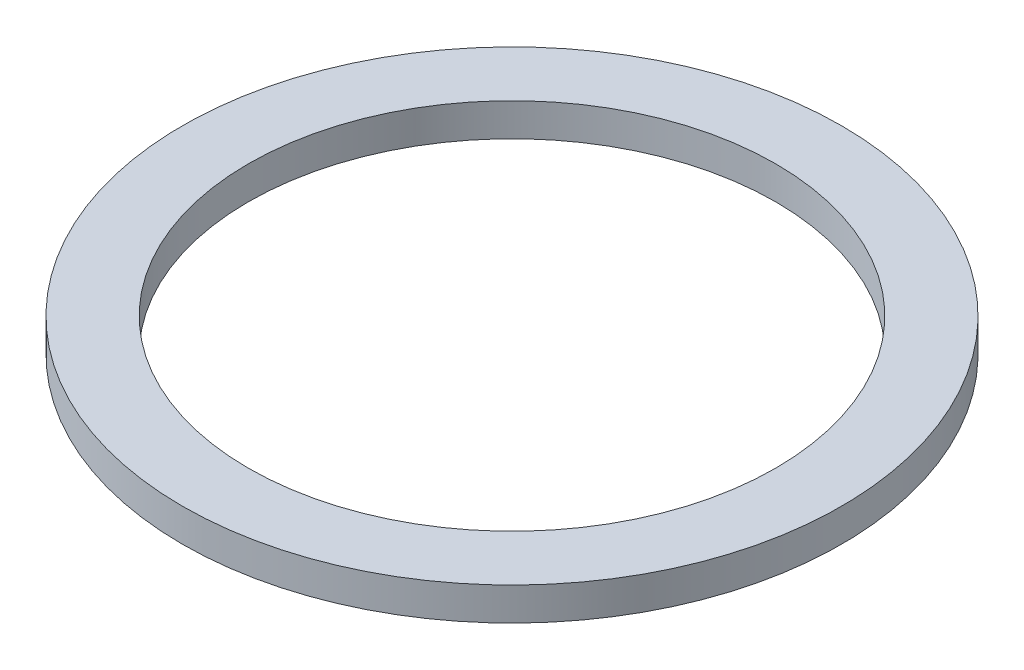
ISO-10303-21;
HEADER;
FILE_DESCRIPTION(('STEP AP214'),'2;1');
FILE_NAME('part.step','',(''),(''),'','','');
FILE_SCHEMA(('AUTOMOTIVE_DESIGN { 1 0 10303 214 1 1 1 1 }'));
ENDSEC;
DATA;
#1=APPLICATION_CONTEXT('core data for automotive mechanical design processes');
#2=APPLICATION_PROTOCOL_DEFINITION('international standard','automotive_design',2000,#1);
#3=PRODUCT_CONTEXT('',#1,'mechanical');
#4=PRODUCT('Part','Part','',(#3));
#5=PRODUCT_RELATED_PRODUCT_CATEGORY('part','',(#4));
#6=PRODUCT_DEFINITION_FORMATION('','',#4);
#7=PRODUCT_DEFINITION_CONTEXT('part definition',#1,'design');
#8=PRODUCT_DEFINITION('design','',#6,#7);
#9=PRODUCT_DEFINITION_SHAPE('','',#8);
#10=(LENGTH_UNIT() NAMED_UNIT(*) SI_UNIT(.MILLI.,.METRE.));
#11=(NAMED_UNIT(*) PLANE_ANGLE_UNIT() SI_UNIT($,.RADIAN.));
#12=(NAMED_UNIT(*) SI_UNIT($,.STERADIAN.) SOLID_ANGLE_UNIT());
#13=UNCERTAINTY_MEASURE_WITH_UNIT(LENGTH_MEASURE(1.E-05),#10,'distance_accuracy_value','');
#14=(GEOMETRIC_REPRESENTATION_CONTEXT(3) GLOBAL_UNCERTAINTY_ASSIGNED_CONTEXT((#13)) GLOBAL_UNIT_ASSIGNED_CONTEXT((#10,
#11,#12)) REPRESENTATION_CONTEXT('',''));
#15=CARTESIAN_POINT('',(0.,0.,0.));
#16=DIRECTION('',(0.,0.,1.));
#17=DIRECTION('',(1.,0.,0.));
#18=AXIS2_PLACEMENT_3D('',#15,#16,#17);
#19=CARTESIAN_POINT('',(0.,0.1,0.));
#20=DIRECTION('',(0.,1.,0.));
#21=DIRECTION('',(0.,0.,1.));
#22=AXIS2_PLACEMENT_3D('',#19,#20,#21);
#23=PLANE('',#22);
#24=CARTESIAN_POINT('',(0.,0.1,0.));
#25=DIRECTION('',(0.,1.,0.));
#26=DIRECTION('',(0.,0.,1.));
#27=AXIS2_PLACEMENT_3D('',#24,#25,#26);
#28=CIRCLE('',#27,1.);
#29=CARTESIAN_POINT('',(0.,0.1,1.));
#30=VERTEX_POINT('',#29);
#31=EDGE_CURVE('E11',#30,#30,#28,.T.);
#32=ORIENTED_EDGE('',*,*,#31,.T.);
#33=EDGE_LOOP('',(#32));
#34=FACE_BOUND('',#33,.T.);
#35=CARTESIAN_POINT('',(0.,0.1,0.));
#36=DIRECTION('',(0.,1.,0.));
#37=DIRECTION('',(1.,0.,0.));
#38=AXIS2_PLACEMENT_3D('',#35,#36,#37);
#39=CIRCLE('',#38,0.8);
#40=CARTESIAN_POINT('',(0.8,0.1,0.));
#41=VERTEX_POINT('',#40);
#42=EDGE_CURVE('E51',#41,#41,#39,.T.);
#43=ORIENTED_EDGE('',*,*,#42,.F.);
#44=EDGE_LOOP('',(#43));
#45=FACE_BOUND('',#44,.T.);
#46=ADVANCED_FACE('F40',(#34,#45),#23,.T.);
#47=CARTESIAN_POINT('',(0.,0.,0.));
#48=DIRECTION('',(0.,1.,0.));
#49=DIRECTION('',(0.,0.,1.));
#50=AXIS2_PLACEMENT_3D('',#47,#48,#49);
#51=PLANE('',#50);
#52=CARTESIAN_POINT('',(0.,0.,0.));
#53=DIRECTION('',(0.,1.,0.));
#54=DIRECTION('',(0.,0.,1.));
#55=AXIS2_PLACEMENT_3D('',#52,#53,#54);
#56=CIRCLE('',#55,1.);
#57=CARTESIAN_POINT('',(0.,0.,1.));
#58=VERTEX_POINT('',#57);
#59=EDGE_CURVE('E44',#58,#58,#56,.T.);
#60=ORIENTED_EDGE('',*,*,#59,.F.);
#61=EDGE_LOOP('',(#60));
#62=FACE_BOUND('',#61,.T.);
#63=CARTESIAN_POINT('',(0.,0.,0.));
#64=DIRECTION('',(0.,1.,0.));
#65=DIRECTION('',(1.,0.,0.));
#66=AXIS2_PLACEMENT_3D('',#63,#64,#65);
#67=CIRCLE('',#66,0.8);
#68=CARTESIAN_POINT('',(0.8,0.,0.));
#69=VERTEX_POINT('',#68);
#70=EDGE_CURVE('E53',#69,#69,#67,.T.);
#71=ORIENTED_EDGE('',*,*,#70,.T.);
#72=EDGE_LOOP('',(#71));
#73=FACE_BOUND('',#72,.T.);
#74=ADVANCED_FACE('F63',(#62,#73),#51,.F.);
#75=CARTESIAN_POINT('',(0.,0.1,0.));
#76=DIRECTION('',(0.,-1.,0.));
#77=DIRECTION('',(0.,0.,-1.));
#78=AXIS2_PLACEMENT_3D('',#75,#76,#77);
#79=CYLINDRICAL_SURFACE('',#78,1.);
#80=ORIENTED_EDGE('',*,*,#31,.F.);
#81=EDGE_LOOP('',(#80));
#82=FACE_BOUND('',#81,.T.);
#83=ORIENTED_EDGE('',*,*,#59,.T.);
#84=EDGE_LOOP('',(#83));
#85=FACE_BOUND('',#84,.T.);
#86=ADVANCED_FACE('F42',(#82,#85),#79,.T.);
#87=CARTESIAN_POINT('',(0.,0.1,0.));
#88=DIRECTION('',(0.,-1.,0.));
#89=DIRECTION('',(0.,0.,-1.));
#90=AXIS2_PLACEMENT_3D('',#87,#88,#89);
#91=CYLINDRICAL_SURFACE('',#90,0.8);
#92=ORIENTED_EDGE('',*,*,#42,.T.);
#93=EDGE_LOOP('',(#92));
#94=FACE_BOUND('',#93,.T.);
#95=ORIENTED_EDGE('',*,*,#70,.F.);
#96=EDGE_LOOP('',(#95));
#97=FACE_BOUND('',#96,.T.);
#98=ADVANCED_FACE('F59',(#94,#97),#91,.F.);
#99=CLOSED_SHELL('',(#46,#74,#86,#98));
#100=MANIFOLD_SOLID_BREP('B2',#99);
#101=ADVANCED_BREP_SHAPE_REPRESENTATION('',(#18,#100),#14);
#102=SHAPE_DEFINITION_REPRESENTATION(#9,#101);
ENDSEC;
END-ISO-10303-21;
